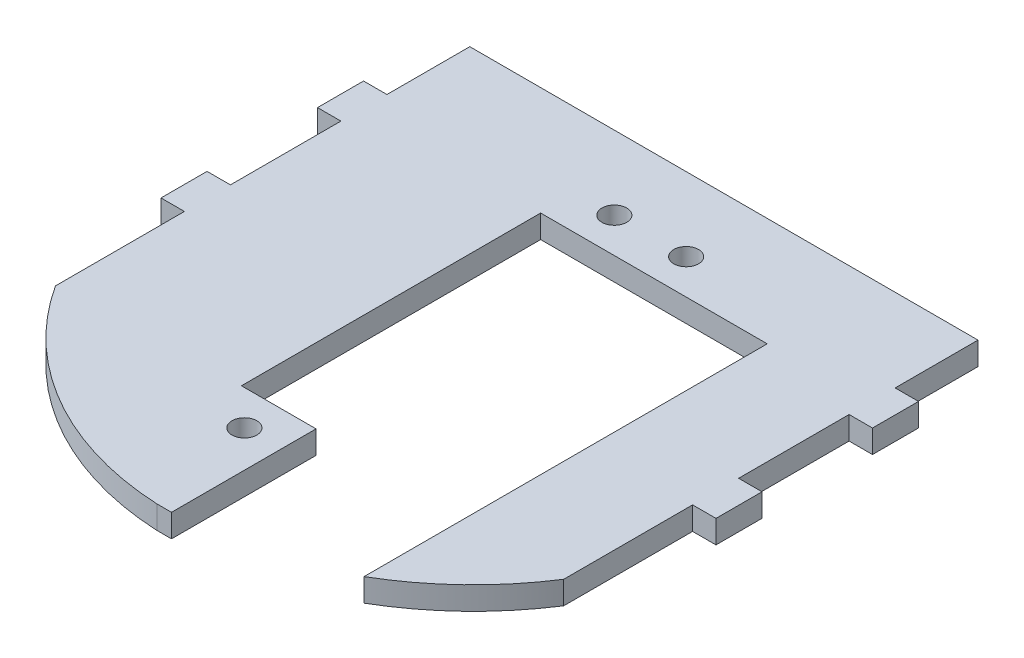
ISO-10303-21;
HEADER;
FILE_DESCRIPTION(('STEP AP214'),'2;1');
FILE_NAME('part.step','',(''),(''),'','','');
FILE_SCHEMA(('AUTOMOTIVE_DESIGN { 1 0 10303 214 1 1 1 1 }'));
ENDSEC;
DATA;
#1=APPLICATION_CONTEXT('core data for automotive mechanical design processes');
#2=APPLICATION_PROTOCOL_DEFINITION('international standard','automotive_design',2000,#1);
#3=PRODUCT_CONTEXT('',#1,'mechanical');
#4=PRODUCT('Part','Part','',(#3));
#5=PRODUCT_RELATED_PRODUCT_CATEGORY('part','',(#4));
#6=PRODUCT_DEFINITION_FORMATION('','',#4);
#7=PRODUCT_DEFINITION_CONTEXT('part definition',#1,'design');
#8=PRODUCT_DEFINITION('design','',#6,#7);
#9=PRODUCT_DEFINITION_SHAPE('','',#8);
#10=(LENGTH_UNIT() NAMED_UNIT(*) SI_UNIT(.MILLI.,.METRE.));
#11=(NAMED_UNIT(*) PLANE_ANGLE_UNIT() SI_UNIT($,.RADIAN.));
#12=(NAMED_UNIT(*) SI_UNIT($,.STERADIAN.) SOLID_ANGLE_UNIT());
#13=UNCERTAINTY_MEASURE_WITH_UNIT(LENGTH_MEASURE(1.E-05),#10,'distance_accuracy_value','');
#14=(GEOMETRIC_REPRESENTATION_CONTEXT(3) GLOBAL_UNCERTAINTY_ASSIGNED_CONTEXT((#13)) GLOBAL_UNIT_ASSIGNED_CONTEXT((#10,
#11,#12)) REPRESENTATION_CONTEXT('',''));
#15=CARTESIAN_POINT('',(0.,0.,0.));
#16=DIRECTION('',(0.,0.,1.));
#17=DIRECTION('',(1.,0.,0.));
#18=AXIS2_PLACEMENT_3D('',#15,#16,#17);
#19=CARTESIAN_POINT('',(35.052,3.175,25.4));
#20=DIRECTION('',(-1.,0.,0.));
#21=DIRECTION('',(0.,0.,1.));
#22=AXIS2_PLACEMENT_3D('',#19,#20,#21);
#23=PLANE('',#22);
#24=DIRECTION('',(0.,1.,0.));
#25=VECTOR('',#24,1.);
#26=CARTESIAN_POINT('',(35.052,0.,7.62));
#27=LINE('',#26,#25);
#28=CARTESIAN_POINT('',(35.052,0.,7.62));
#29=VERTEX_POINT('',#28);
#30=CARTESIAN_POINT('',(35.052,3.175,7.62));
#31=VERTEX_POINT('',#30);
#32=EDGE_CURVE('E367',#29,#31,#27,.T.);
#33=ORIENTED_EDGE('',*,*,#32,.F.);
#34=DIRECTION('',(0.,0.,-1.));
#35=VECTOR('',#34,1.);
#36=CARTESIAN_POINT('',(35.052,0.,25.4));
#37=LINE('',#36,#35);
#38=CARTESIAN_POINT('',(35.052,0.,-7.62));
#39=VERTEX_POINT('',#38);
#40=EDGE_CURVE('E290',#29,#39,#37,.T.);
#41=ORIENTED_EDGE('',*,*,#40,.T.);
#42=DIRECTION('',(0.,1.,0.));
#43=VECTOR('',#42,1.);
#44=CARTESIAN_POINT('',(35.052,0.,-7.62));
#45=LINE('',#44,#43);
#46=CARTESIAN_POINT('',(35.052,3.175,-7.62));
#47=VERTEX_POINT('',#46);
#48=EDGE_CURVE('E324',#39,#47,#45,.T.);
#49=ORIENTED_EDGE('',*,*,#48,.T.);
#50=DIRECTION('',(0.,0.,-1.));
#51=VECTOR('',#50,1.);
#52=CARTESIAN_POINT('',(35.052,3.175,25.4));
#53=LINE('',#52,#51);
#54=EDGE_CURVE('E306',#31,#47,#53,.T.);
#55=ORIENTED_EDGE('',*,*,#54,.F.);
#56=EDGE_LOOP('',(#33,#41,#49,#55));
#57=FACE_BOUND('',#56,.T.);
#58=ADVANCED_FACE('F33',(#57),#23,.F.);
#59=CARTESIAN_POINT('',(35.052,3.175,31.75));
#60=VERTEX_POINT('',#59);
#61=CARTESIAN_POINT('',(35.052,3.175,13.97));
#62=VERTEX_POINT('',#61);
#63=EDGE_CURVE('E36',#60,#62,#53,.T.);
#64=ORIENTED_EDGE('',*,*,#63,.F.);
#65=DIRECTION('',(0.,1.,0.));
#66=VECTOR('',#65,1.);
#67=CARTESIAN_POINT('',(35.052,-5.00000000001367E-05,31.75));
#68=LINE('',#67,#66);
#69=CARTESIAN_POINT('',(35.052,0.,31.75));
#70=VERTEX_POINT('',#69);
#71=EDGE_CURVE('E227',#70,#60,#68,.T.);
#72=ORIENTED_EDGE('',*,*,#71,.F.);
#73=CARTESIAN_POINT('',(35.052,0.,13.97));
#74=VERTEX_POINT('',#73);
#75=EDGE_CURVE('E289',#70,#74,#37,.T.);
#76=ORIENTED_EDGE('',*,*,#75,.T.);
#77=DIRECTION('',(0.,1.,0.));
#78=VECTOR('',#77,1.);
#79=CARTESIAN_POINT('',(35.052,0.,13.97));
#80=LINE('',#79,#78);
#81=EDGE_CURVE('E374',#74,#62,#80,.T.);
#82=ORIENTED_EDGE('',*,*,#81,.T.);
#83=EDGE_LOOP('',(#64,#72,#76,#82));
#84=FACE_BOUND('',#83,.T.);
#85=ADVANCED_FACE('F400',(#84),#23,.F.);
#86=DIRECTION('',(0.,1.,0.));
#87=VECTOR('',#86,1.);
#88=CARTESIAN_POINT('',(35.052,0.,-13.97));
#89=LINE('',#88,#87);
#90=CARTESIAN_POINT('',(35.052,0.,-13.97));
#91=VERTEX_POINT('',#90);
#92=CARTESIAN_POINT('',(35.052,3.175,-13.97));
#93=VERTEX_POINT('',#92);
#94=EDGE_CURVE('E328',#91,#93,#89,.T.);
#95=ORIENTED_EDGE('',*,*,#94,.F.);
#96=CARTESIAN_POINT('',(35.052,0.,-25.4));
#97=VERTEX_POINT('',#96);
#98=EDGE_CURVE('E246',#91,#97,#37,.T.);
#99=ORIENTED_EDGE('',*,*,#98,.T.);
#100=DIRECTION('',(0.,-1.,0.));
#101=VECTOR('',#100,1.);
#102=CARTESIAN_POINT('',(35.052,3.175,-25.4));
#103=LINE('',#102,#101);
#104=CARTESIAN_POINT('',(35.052,3.175,-25.4));
#105=VERTEX_POINT('',#104);
#106=EDGE_CURVE('E269',#105,#97,#103,.T.);
#107=ORIENTED_EDGE('',*,*,#106,.F.);
#108=EDGE_CURVE('E308',#93,#105,#53,.T.);
#109=ORIENTED_EDGE('',*,*,#108,.F.);
#110=EDGE_LOOP('',(#95,#99,#107,#109));
#111=FACE_BOUND('',#110,.T.);
#112=ADVANCED_FACE('F401',(#111),#23,.F.);
#113=CARTESIAN_POINT('',(-35.052,3.175,25.4));
#114=DIRECTION('',(1.,0.,0.));
#115=DIRECTION('',(0.,0.,-1.));
#116=AXIS2_PLACEMENT_3D('',#113,#114,#115);
#117=PLANE('',#116);
#118=DIRECTION('',(0.,0.,1.));
#119=VECTOR('',#118,1.);
#120=CARTESIAN_POINT('',(-35.052,0.,25.4));
#121=LINE('',#120,#119);
#122=CARTESIAN_POINT('',(-35.052,0.,-7.62));
#123=VERTEX_POINT('',#122);
#124=CARTESIAN_POINT('',(-35.052,0.,7.62));
#125=VERTEX_POINT('',#124);
#126=EDGE_CURVE('E259',#123,#125,#121,.T.);
#127=ORIENTED_EDGE('',*,*,#126,.T.);
#128=DIRECTION('',(0.,1.,0.));
#129=VECTOR('',#128,1.);
#130=CARTESIAN_POINT('',(-35.052,0.,7.62));
#131=LINE('',#130,#129);
#132=CARTESIAN_POINT('',(-35.052,3.175,7.62));
#133=VERTEX_POINT('',#132);
#134=EDGE_CURVE('E458',#125,#133,#131,.T.);
#135=ORIENTED_EDGE('',*,*,#134,.T.);
#136=DIRECTION('',(0.,0.,1.));
#137=VECTOR('',#136,1.);
#138=CARTESIAN_POINT('',(-35.052,3.175,25.4));
#139=LINE('',#138,#137);
#140=CARTESIAN_POINT('',(-35.052,3.175,-7.62));
#141=VERTEX_POINT('',#140);
#142=EDGE_CURVE('E234',#141,#133,#139,.T.);
#143=ORIENTED_EDGE('',*,*,#142,.F.);
#144=DIRECTION('',(0.,1.,0.));
#145=VECTOR('',#144,1.);
#146=CARTESIAN_POINT('',(-35.052,0.,-7.62));
#147=LINE('',#146,#145);
#148=EDGE_CURVE('E450',#123,#141,#147,.T.);
#149=ORIENTED_EDGE('',*,*,#148,.F.);
#150=EDGE_LOOP('',(#127,#135,#143,#149));
#151=FACE_BOUND('',#150,.T.);
#152=ADVANCED_FACE('F406',(#151),#117,.F.);
#153=CARTESIAN_POINT('',(-35.052,0.,13.97));
#154=VERTEX_POINT('',#153);
#155=CARTESIAN_POINT('',(-35.052,0.,31.75));
#156=VERTEX_POINT('',#155);
#157=EDGE_CURVE('E226',#154,#156,#121,.T.);
#158=ORIENTED_EDGE('',*,*,#157,.T.);
#159=DIRECTION('',(0.,1.,0.));
#160=VECTOR('',#159,1.);
#161=CARTESIAN_POINT('',(-35.052,-5.00000000001367E-05,31.75));
#162=LINE('',#161,#160);
#163=CARTESIAN_POINT('',(-35.052,3.175,31.75));
#164=VERTEX_POINT('',#163);
#165=EDGE_CURVE('E214',#156,#164,#162,.T.);
#166=ORIENTED_EDGE('',*,*,#165,.T.);
#167=CARTESIAN_POINT('',(-35.052,3.175,13.97));
#168=VERTEX_POINT('',#167);
#169=EDGE_CURVE('E224',#168,#164,#139,.T.);
#170=ORIENTED_EDGE('',*,*,#169,.F.);
#171=DIRECTION('',(0.,1.,0.));
#172=VECTOR('',#171,1.);
#173=CARTESIAN_POINT('',(-35.052,0.,13.97));
#174=LINE('',#173,#172);
#175=EDGE_CURVE('E461',#154,#168,#174,.T.);
#176=ORIENTED_EDGE('',*,*,#175,.F.);
#177=EDGE_LOOP('',(#158,#166,#170,#176));
#178=FACE_BOUND('',#177,.T.);
#179=ADVANCED_FACE('F222',(#178),#117,.F.);
#180=CARTESIAN_POINT('',(-35.052,3.175,-25.4));
#181=DIRECTION('',(0.,0.,1.));
#182=DIRECTION('',(1.,0.,0.));
#183=AXIS2_PLACEMENT_3D('',#180,#181,#182);
#184=PLANE('',#183);
#185=DIRECTION('',(-1.,0.,0.));
#186=VECTOR('',#185,1.);
#187=CARTESIAN_POINT('',(-35.052,0.,-25.4));
#188=LINE('',#187,#186);
#189=CARTESIAN_POINT('',(-35.052,0.,-25.4));
#190=VERTEX_POINT('',#189);
#191=EDGE_CURVE('E265',#97,#190,#188,.T.);
#192=ORIENTED_EDGE('',*,*,#191,.T.);
#193=DIRECTION('',(0.,-1.,0.));
#194=VECTOR('',#193,1.);
#195=CARTESIAN_POINT('',(-35.052,3.175,-25.4));
#196=LINE('',#195,#194);
#197=CARTESIAN_POINT('',(-35.052,3.175,-25.4));
#198=VERTEX_POINT('',#197);
#199=EDGE_CURVE('E258',#198,#190,#196,.T.);
#200=ORIENTED_EDGE('',*,*,#199,.F.);
#201=DIRECTION('',(-1.,0.,0.));
#202=VECTOR('',#201,1.);
#203=CARTESIAN_POINT('',(-35.052,3.175,-25.4));
#204=LINE('',#203,#202);
#205=EDGE_CURVE('E235',#105,#198,#204,.T.);
#206=ORIENTED_EDGE('',*,*,#205,.F.);
#207=ORIENTED_EDGE('',*,*,#106,.T.);
#208=EDGE_LOOP('',(#192,#200,#206,#207));
#209=FACE_BOUND('',#208,.T.);
#210=ADVANCED_FACE('F416',(#209),#184,.F.);
#211=CARTESIAN_POINT('',(-35.052,0.,-13.97));
#212=VERTEX_POINT('',#211);
#213=EDGE_CURVE('E261',#190,#212,#121,.T.);
#214=ORIENTED_EDGE('',*,*,#213,.T.);
#215=DIRECTION('',(0.,1.,0.));
#216=VECTOR('',#215,1.);
#217=CARTESIAN_POINT('',(-35.052,0.,-13.97));
#218=LINE('',#217,#216);
#219=CARTESIAN_POINT('',(-35.052,3.175,-13.97));
#220=VERTEX_POINT('',#219);
#221=EDGE_CURVE('E422',#212,#220,#218,.T.);
#222=ORIENTED_EDGE('',*,*,#221,.T.);
#223=EDGE_CURVE('E238',#198,#220,#139,.T.);
#224=ORIENTED_EDGE('',*,*,#223,.F.);
#225=ORIENTED_EDGE('',*,*,#199,.T.);
#226=EDGE_LOOP('',(#214,#222,#224,#225));
#227=FACE_BOUND('',#226,.T.);
#228=ADVANCED_FACE('F413',(#227),#117,.F.);
#229=CARTESIAN_POINT('',(35.052,3.175,-25.4));
#230=DIRECTION('',(0.,-1.,0.));
#231=DIRECTION('',(0.,0.,-1.));
#232=AXIS2_PLACEMENT_3D('',#229,#230,#231);
#233=PLANE('',#232);
#234=CARTESIAN_POINT('',(-5.05620664108055,3.175,35.687));
#235=DIRECTION('',(0.,1.,0.));
#236=DIRECTION('',(0.,0.,1.));
#237=AXIS2_PLACEMENT_3D('',#234,#235,#236);
#238=CIRCLE('',#237,1.7145);
#239=CARTESIAN_POINT('',(-5.05620664108055,3.175,37.4015));
#240=VERTEX_POINT('',#239);
#241=EDGE_CURVE('E802',#240,#240,#238,.T.);
#242=ORIENTED_EDGE('',*,*,#241,.F.);
#243=EDGE_LOOP('',(#242));
#244=FACE_BOUND('',#243,.T.);
#245=CARTESIAN_POINT('',(-4.95500000000003,3.175,-15.24));
#246=DIRECTION('',(0.,1.,0.));
#247=DIRECTION('',(0.,0.,1.));
#248=AXIS2_PLACEMENT_3D('',#245,#246,#247);
#249=CIRCLE('',#248,1.7145);
#250=CARTESIAN_POINT('',(-4.95500000000003,3.175,-13.5255));
#251=VERTEX_POINT('',#250);
#252=EDGE_CURVE('E799',#251,#251,#249,.T.);
#253=ORIENTED_EDGE('',*,*,#252,.F.);
#254=EDGE_LOOP('',(#253));
#255=FACE_BOUND('',#254,.T.);
#256=CARTESIAN_POINT('',(4.95499999999996,3.175,-15.24));
#257=DIRECTION('',(0.,1.,0.));
#258=DIRECTION('',(0.,0.,1.));
#259=AXIS2_PLACEMENT_3D('',#256,#257,#258);
#260=CIRCLE('',#259,1.7145);
#261=CARTESIAN_POINT('',(4.95499999999996,3.175,-13.5255));
#262=VERTEX_POINT('',#261);
#263=EDGE_CURVE('E795',#262,#262,#260,.T.);
#264=ORIENTED_EDGE('',*,*,#263,.F.);
#265=EDGE_LOOP('',(#264));
#266=FACE_BOUND('',#265,.T.);
#267=ORIENTED_EDGE('',*,*,#169,.T.);
#268=CARTESIAN_POINT('',(0.,3.175,9.13421887485182));
#269=DIRECTION('',(0.,-1.,0.));
#270=DIRECTION('',(0.,0.,1.));
#271=AXIS2_PLACEMENT_3D('',#268,#269,#270);
#272=CIRCLE('',#271,41.7147007648456);
#273=CARTESIAN_POINT('',(-2.01963935687884,3.175,50.8));
#274=VERTEX_POINT('',#273);
#275=EDGE_CURVE('E211',#274,#164,#272,.T.);
#276=ORIENTED_EDGE('',*,*,#275,.F.);
#277=DIRECTION('',(1.,0.,0.));
#278=VECTOR('',#277,1.);
#279=CARTESIAN_POINT('',(35.052,3.175,50.8));
#280=LINE('',#279,#278);
#281=CARTESIAN_POINT('',(0.,3.175,50.8));
#282=VERTEX_POINT('',#281);
#283=EDGE_CURVE('E792',#274,#282,#280,.T.);
#284=ORIENTED_EDGE('',*,*,#283,.T.);
#285=DIRECTION('',(0.,0.,1.));
#286=VECTOR('',#285,1.);
#287=CARTESIAN_POINT('',(0.,3.175,30.861));
#288=LINE('',#287,#286);
#289=CARTESIAN_POINT('',(0.,3.175,30.861));
#290=VERTEX_POINT('',#289);
#291=EDGE_CURVE('E829',#290,#282,#288,.T.);
#292=ORIENTED_EDGE('',*,*,#291,.F.);
#293=DIRECTION('',(1.,0.,0.));
#294=VECTOR('',#293,1.);
#295=CARTESIAN_POINT('',(-10.2930000000001,3.175,30.861));
#296=LINE('',#295,#294);
#297=CARTESIAN_POINT('',(-10.2930000000001,3.175,30.861));
#298=VERTEX_POINT('',#297);
#299=EDGE_CURVE('E812',#298,#290,#296,.T.);
#300=ORIENTED_EDGE('',*,*,#299,.F.);
#301=DIRECTION('',(0.,0.,1.));
#302=VECTOR('',#301,1.);
#303=CARTESIAN_POINT('',(-10.2930000000001,3.175,-10.414));
#304=LINE('',#303,#302);
#305=CARTESIAN_POINT('',(-10.2930000000001,3.175,-10.414));
#306=VERTEX_POINT('',#305);
#307=EDGE_CURVE('E815',#306,#298,#304,.T.);
#308=ORIENTED_EDGE('',*,*,#307,.F.);
#309=DIRECTION('',(-1.,0.,0.));
#310=VECTOR('',#309,1.);
#311=CARTESIAN_POINT('',(10.293,3.175,-10.414));
#312=LINE('',#311,#310);
#313=CARTESIAN_POINT('',(20.961,3.175,-10.414));
#314=VERTEX_POINT('',#313);
#315=EDGE_CURVE('E808',#314,#306,#312,.T.);
#316=ORIENTED_EDGE('',*,*,#315,.F.);
#317=DIRECTION('',(0.,0.,-1.));
#318=VECTOR('',#317,1.);
#319=CARTESIAN_POINT('',(20.961,3.175,50.8));
#320=LINE('',#319,#318);
#321=CARTESIAN_POINT('',(20.961,3.175,45.2001687292589));
#322=VERTEX_POINT('',#321);
#323=EDGE_CURVE('E825',#322,#314,#320,.T.);
#324=ORIENTED_EDGE('',*,*,#323,.F.);
#325=EDGE_CURVE('E58',#60,#322,#272,.T.);
#326=ORIENTED_EDGE('',*,*,#325,.F.);
#327=ORIENTED_EDGE('',*,*,#63,.T.);
#328=DIRECTION('',(-1.,0.,0.));
#329=VECTOR('',#328,1.);
#330=CARTESIAN_POINT('',(35.052,3.175,13.97));
#331=LINE('',#330,#329);
#332=CARTESIAN_POINT('',(38.2778,3.175,13.97));
#333=VERTEX_POINT('',#332);
#334=EDGE_CURVE('E782',#333,#62,#331,.T.);
#335=ORIENTED_EDGE('',*,*,#334,.F.);
#336=DIRECTION('',(0.,0.,1.));
#337=VECTOR('',#336,1.);
#338=CARTESIAN_POINT('',(38.2778,3.175,7.62));
#339=LINE('',#338,#337);
#340=CARTESIAN_POINT('',(38.2778,3.175,7.62));
#341=VERTEX_POINT('',#340);
#342=EDGE_CURVE('E783',#341,#333,#339,.T.);
#343=ORIENTED_EDGE('',*,*,#342,.F.);
#344=DIRECTION('',(1.,0.,0.));
#345=VECTOR('',#344,1.);
#346=CARTESIAN_POINT('',(35.052,3.175,7.62));
#347=LINE('',#346,#345);
#348=EDGE_CURVE('E365',#31,#341,#347,.T.);
#349=ORIENTED_EDGE('',*,*,#348,.F.);
#350=ORIENTED_EDGE('',*,*,#54,.T.);
#351=DIRECTION('',(-1.,0.,0.));
#352=VECTOR('',#351,1.);
#353=CARTESIAN_POINT('',(35.052,3.175,-7.62));
#354=LINE('',#353,#352);
#355=CARTESIAN_POINT('',(38.2778,3.175,-7.62));
#356=VERTEX_POINT('',#355);
#357=EDGE_CURVE('E317',#356,#47,#354,.T.);
#358=ORIENTED_EDGE('',*,*,#357,.F.);
#359=DIRECTION('',(0.,0.,1.));
#360=VECTOR('',#359,1.);
#361=CARTESIAN_POINT('',(38.2778,3.175,-7.62));
#362=LINE('',#361,#360);
#363=CARTESIAN_POINT('',(38.2778,3.175,-13.97));
#364=VERTEX_POINT('',#363);
#365=EDGE_CURVE('E320',#364,#356,#362,.T.);
#366=ORIENTED_EDGE('',*,*,#365,.F.);
#367=DIRECTION('',(1.,0.,0.));
#368=VECTOR('',#367,1.);
#369=CARTESIAN_POINT('',(35.052,3.175,-13.97));
#370=LINE('',#369,#368);
#371=EDGE_CURVE('E347',#93,#364,#370,.T.);
#372=ORIENTED_EDGE('',*,*,#371,.F.);
#373=ORIENTED_EDGE('',*,*,#108,.T.);
#374=ORIENTED_EDGE('',*,*,#205,.T.);
#375=ORIENTED_EDGE('',*,*,#223,.T.);
#376=DIRECTION('',(-1.,0.,0.));
#377=VECTOR('',#376,1.);
#378=CARTESIAN_POINT('',(-35.052,3.175,-13.97));
#379=LINE('',#378,#377);
#380=CARTESIAN_POINT('',(-38.2778,3.175,-13.97));
#381=VERTEX_POINT('',#380);
#382=EDGE_CURVE('E425',#220,#381,#379,.T.);
#383=ORIENTED_EDGE('',*,*,#382,.T.);
#384=DIRECTION('',(0.,0.,1.));
#385=VECTOR('',#384,1.);
#386=CARTESIAN_POINT('',(-38.2778,3.175,-7.62));
#387=LINE('',#386,#385);
#388=CARTESIAN_POINT('',(-38.2778,3.175,-7.62));
#389=VERTEX_POINT('',#388);
#390=EDGE_CURVE('E428',#381,#389,#387,.T.);
#391=ORIENTED_EDGE('',*,*,#390,.T.);
#392=DIRECTION('',(1.,0.,0.));
#393=VECTOR('',#392,1.);
#394=CARTESIAN_POINT('',(-35.052,3.175,-7.62));
#395=LINE('',#394,#393);
#396=EDGE_CURVE('E430',#389,#141,#395,.T.);
#397=ORIENTED_EDGE('',*,*,#396,.T.);
#398=ORIENTED_EDGE('',*,*,#142,.T.);
#399=DIRECTION('',(-1.,0.,0.));
#400=VECTOR('',#399,1.);
#401=CARTESIAN_POINT('',(-35.052,3.175,7.62));
#402=LINE('',#401,#400);
#403=CARTESIAN_POINT('',(-38.2778,3.175,7.62));
#404=VERTEX_POINT('',#403);
#405=EDGE_CURVE('E327',#133,#404,#402,.T.);
#406=ORIENTED_EDGE('',*,*,#405,.T.);
#407=DIRECTION('',(0.,0.,1.));
#408=VECTOR('',#407,1.);
#409=CARTESIAN_POINT('',(-38.2778,3.175,7.62));
#410=LINE('',#409,#408);
#411=CARTESIAN_POINT('',(-38.2778,3.175,13.97));
#412=VERTEX_POINT('',#411);
#413=EDGE_CURVE('E486',#404,#412,#410,.T.);
#414=ORIENTED_EDGE('',*,*,#413,.T.);
#415=DIRECTION('',(1.,0.,0.));
#416=VECTOR('',#415,1.);
#417=CARTESIAN_POINT('',(-35.052,3.175,13.97));
#418=LINE('',#417,#416);
#419=EDGE_CURVE('E233',#412,#168,#418,.T.);
#420=ORIENTED_EDGE('',*,*,#419,.T.);
#421=EDGE_LOOP('',(#267,#276,#284,#292,#300,#308,#316,#324,#326,#327,#335,#343,#349,#350,#358,
#366,#372,#373,#374,#375,#383,#391,#397,#398,#406,#414,#420));
#422=FACE_BOUND('',#421,.T.);
#423=ADVANCED_FACE('F230',(#244,#255,#266,#422),#233,.F.);
#424=CARTESIAN_POINT('',(35.052,0.,-25.4));
#425=DIRECTION('',(0.,-1.,0.));
#426=DIRECTION('',(0.,0.,-1.));
#427=AXIS2_PLACEMENT_3D('',#424,#425,#426);
#428=PLANE('',#427);
#429=CARTESIAN_POINT('',(0.,0.,9.13421887485182));
#430=DIRECTION('',(0.,-1.,0.));
#431=DIRECTION('',(0.,0.,-1.));
#432=AXIS2_PLACEMENT_3D('',#429,#430,#431);
#433=CIRCLE('',#432,41.7147007648456);
#434=CARTESIAN_POINT('',(-2.01963935687868,0.,50.8));
#435=VERTEX_POINT('',#434);
#436=EDGE_CURVE('E50',#156,#435,#433,.F.);
#437=ORIENTED_EDGE('',*,*,#436,.F.);
#438=ORIENTED_EDGE('',*,*,#157,.F.);
#439=DIRECTION('',(1.,0.,0.));
#440=VECTOR('',#439,1.);
#441=CARTESIAN_POINT('',(-35.052,0.,13.97));
#442=LINE('',#441,#440);
#443=CARTESIAN_POINT('',(-38.2778,0.,13.97));
#444=VERTEX_POINT('',#443);
#445=EDGE_CURVE('E470',#444,#154,#442,.T.);
#446=ORIENTED_EDGE('',*,*,#445,.F.);
#447=DIRECTION('',(0.,0.,1.));
#448=VECTOR('',#447,1.);
#449=CARTESIAN_POINT('',(-38.2778,0.,7.62));
#450=LINE('',#449,#448);
#451=CARTESIAN_POINT('',(-38.2778,0.,7.62));
#452=VERTEX_POINT('',#451);
#453=EDGE_CURVE('E476',#452,#444,#450,.T.);
#454=ORIENTED_EDGE('',*,*,#453,.F.);
#455=DIRECTION('',(-1.,0.,0.));
#456=VECTOR('',#455,1.);
#457=CARTESIAN_POINT('',(-35.052,0.,7.62));
#458=LINE('',#457,#456);
#459=EDGE_CURVE('E481',#125,#452,#458,.T.);
#460=ORIENTED_EDGE('',*,*,#459,.F.);
#461=ORIENTED_EDGE('',*,*,#126,.F.);
#462=DIRECTION('',(1.,0.,0.));
#463=VECTOR('',#462,1.);
#464=CARTESIAN_POINT('',(-35.052,0.,-7.62));
#465=LINE('',#464,#463);
#466=CARTESIAN_POINT('',(-38.2778,0.,-7.62));
#467=VERTEX_POINT('',#466);
#468=EDGE_CURVE('E437',#467,#123,#465,.T.);
#469=ORIENTED_EDGE('',*,*,#468,.F.);
#470=DIRECTION('',(0.,0.,1.));
#471=VECTOR('',#470,1.);
#472=CARTESIAN_POINT('',(-38.2778,0.,-7.62));
#473=LINE('',#472,#471);
#474=CARTESIAN_POINT('',(-38.2778,0.,-13.97));
#475=VERTEX_POINT('',#474);
#476=EDGE_CURVE('E443',#475,#467,#473,.T.);
#477=ORIENTED_EDGE('',*,*,#476,.F.);
#478=DIRECTION('',(-1.,0.,0.));
#479=VECTOR('',#478,1.);
#480=CARTESIAN_POINT('',(-35.052,0.,-13.97));
#481=LINE('',#480,#479);
#482=EDGE_CURVE('E439',#212,#475,#481,.T.);
#483=ORIENTED_EDGE('',*,*,#482,.F.);
#484=ORIENTED_EDGE('',*,*,#213,.F.);
#485=ORIENTED_EDGE('',*,*,#191,.F.);
#486=ORIENTED_EDGE('',*,*,#98,.F.);
#487=DIRECTION('',(1.,0.,0.));
#488=VECTOR('',#487,1.);
#489=CARTESIAN_POINT('',(35.052,0.,-13.97));
#490=LINE('',#489,#488);
#491=CARTESIAN_POINT('',(38.2778,0.,-13.97));
#492=VERTEX_POINT('',#491);
#493=EDGE_CURVE('E342',#91,#492,#490,.T.);
#494=ORIENTED_EDGE('',*,*,#493,.T.);
#495=DIRECTION('',(0.,0.,1.));
#496=VECTOR('',#495,1.);
#497=CARTESIAN_POINT('',(38.2778,0.,-7.62));
#498=LINE('',#497,#496);
#499=CARTESIAN_POINT('',(38.2778,0.,-7.62));
#500=VERTEX_POINT('',#499);
#501=EDGE_CURVE('E345',#492,#500,#498,.T.);
#502=ORIENTED_EDGE('',*,*,#501,.T.);
#503=DIRECTION('',(-1.,0.,0.));
#504=VECTOR('',#503,1.);
#505=CARTESIAN_POINT('',(35.052,0.,-7.62));
#506=LINE('',#505,#504);
#507=EDGE_CURVE('E329',#500,#39,#506,.T.);
#508=ORIENTED_EDGE('',*,*,#507,.T.);
#509=ORIENTED_EDGE('',*,*,#40,.F.);
#510=DIRECTION('',(1.,0.,0.));
#511=VECTOR('',#510,1.);
#512=CARTESIAN_POINT('',(35.052,0.,7.62));
#513=LINE('',#512,#511);
#514=CARTESIAN_POINT('',(38.2778,0.,7.62));
#515=VERTEX_POINT('',#514);
#516=EDGE_CURVE('E373',#29,#515,#513,.T.);
#517=ORIENTED_EDGE('',*,*,#516,.T.);
#518=DIRECTION('',(0.,0.,1.));
#519=VECTOR('',#518,1.);
#520=CARTESIAN_POINT('',(38.2778,0.,7.62));
#521=LINE('',#520,#519);
#522=CARTESIAN_POINT('',(38.2778,0.,13.97));
#523=VERTEX_POINT('',#522);
#524=EDGE_CURVE('E375',#515,#523,#521,.T.);
#525=ORIENTED_EDGE('',*,*,#524,.T.);
#526=DIRECTION('',(-1.,0.,0.));
#527=VECTOR('',#526,1.);
#528=CARTESIAN_POINT('',(35.052,0.,13.97));
#529=LINE('',#528,#527);
#530=EDGE_CURVE('E379',#523,#74,#529,.T.);
#531=ORIENTED_EDGE('',*,*,#530,.T.);
#532=ORIENTED_EDGE('',*,*,#75,.F.);
#533=CARTESIAN_POINT('',(20.961,0.,45.2001687292589));
#534=VERTEX_POINT('',#533);
#535=EDGE_CURVE('E769',#534,#70,#433,.F.);
#536=ORIENTED_EDGE('',*,*,#535,.F.);
#537=DIRECTION('',(0.,0.,1.));
#538=VECTOR('',#537,1.);
#539=CARTESIAN_POINT('',(20.961,0.,-25.4));
#540=LINE('',#539,#538);
#541=CARTESIAN_POINT('',(20.961,0.,-10.414));
#542=VERTEX_POINT('',#541);
#543=EDGE_CURVE('E817',#542,#534,#540,.T.);
#544=ORIENTED_EDGE('',*,*,#543,.F.);
#545=DIRECTION('',(1.,0.,0.));
#546=VECTOR('',#545,1.);
#547=CARTESIAN_POINT('',(35.052,0.,-10.414));
#548=LINE('',#547,#546);
#549=CARTESIAN_POINT('',(-10.2930000000001,0.,-10.414));
#550=VERTEX_POINT('',#549);
#551=EDGE_CURVE('E275',#550,#542,#548,.T.);
#552=ORIENTED_EDGE('',*,*,#551,.F.);
#553=DIRECTION('',(0.,0.,-1.));
#554=VECTOR('',#553,1.);
#555=CARTESIAN_POINT('',(-10.2930000000001,0.,-25.4));
#556=LINE('',#555,#554);
#557=CARTESIAN_POINT('',(-10.2930000000001,0.,30.861));
#558=VERTEX_POINT('',#557);
#559=EDGE_CURVE('E282',#558,#550,#556,.T.);
#560=ORIENTED_EDGE('',*,*,#559,.F.);
#561=DIRECTION('',(-1.,0.,0.));
#562=VECTOR('',#561,1.);
#563=CARTESIAN_POINT('',(35.052,0.,30.861));
#564=LINE('',#563,#562);
#565=CARTESIAN_POINT('',(0.,0.,30.861));
#566=VERTEX_POINT('',#565);
#567=EDGE_CURVE('E271',#566,#558,#564,.T.);
#568=ORIENTED_EDGE('',*,*,#567,.F.);
#569=DIRECTION('',(0.,0.,-1.));
#570=VECTOR('',#569,1.);
#571=CARTESIAN_POINT('',(-1.11022302462516E-13,0.,-25.3999999999999));
#572=LINE('',#571,#570);
#573=CARTESIAN_POINT('',(0.,0.,50.8));
#574=VERTEX_POINT('',#573);
#575=EDGE_CURVE('E819',#574,#566,#572,.T.);
#576=ORIENTED_EDGE('',*,*,#575,.F.);
#577=DIRECTION('',(1.,0.,0.));
#578=VECTOR('',#577,1.);
#579=CARTESIAN_POINT('',(35.052,0.,50.8));
#580=LINE('',#579,#578);
#581=EDGE_CURVE('E786',#435,#574,#580,.T.);
#582=ORIENTED_EDGE('',*,*,#581,.F.);
#583=EDGE_LOOP('',(#437,#438,#446,#454,#460,#461,#469,#477,#483,#484,#485,#486,#494,#502,#508,
#509,#517,#525,#531,#532,#536,#544,#552,#560,#568,#576,#582));
#584=FACE_BOUND('',#583,.T.);
#585=CARTESIAN_POINT('',(-5.05620664108055,0.,35.687));
#586=DIRECTION('',(0.,-1.,0.));
#587=DIRECTION('',(0.,0.,-1.));
#588=AXIS2_PLACEMENT_3D('',#585,#586,#587);
#589=CIRCLE('',#588,1.7145);
#590=CARTESIAN_POINT('',(-5.05620664108055,0.,33.9725));
#591=VERTEX_POINT('',#590);
#592=EDGE_CURVE('E285',#591,#591,#589,.T.);
#593=ORIENTED_EDGE('',*,*,#592,.F.);
#594=EDGE_LOOP('',(#593));
#595=FACE_BOUND('',#594,.T.);
#596=CARTESIAN_POINT('',(-4.95500000000003,0.,-15.24));
#597=DIRECTION('',(0.,-1.,0.));
#598=DIRECTION('',(0.,0.,-1.));
#599=AXIS2_PLACEMENT_3D('',#596,#597,#598);
#600=CIRCLE('',#599,1.7145);
#601=CARTESIAN_POINT('',(-4.95500000000003,0.,-16.9545));
#602=VERTEX_POINT('',#601);
#603=EDGE_CURVE('E798',#602,#602,#600,.T.);
#604=ORIENTED_EDGE('',*,*,#603,.F.);
#605=EDGE_LOOP('',(#604));
#606=FACE_BOUND('',#605,.T.);
#607=CARTESIAN_POINT('',(4.95499999999996,0.,-15.24));
#608=DIRECTION('',(0.,-1.,0.));
#609=DIRECTION('',(0.,0.,-1.));
#610=AXIS2_PLACEMENT_3D('',#607,#608,#609);
#611=CIRCLE('',#610,1.7145);
#612=CARTESIAN_POINT('',(4.95499999999996,0.,-16.9545));
#613=VERTEX_POINT('',#612);
#614=EDGE_CURVE('E309',#613,#613,#611,.T.);
#615=ORIENTED_EDGE('',*,*,#614,.F.);
#616=EDGE_LOOP('',(#615));
#617=FACE_BOUND('',#616,.T.);
#618=ADVANCED_FACE('F383',(#584,#595,#606,#617),#428,.T.);
#619=CARTESIAN_POINT('',(-35.052,0.,-7.62));
#620=DIRECTION('',(0.,0.,1.));
#621=DIRECTION('',(1.,0.,0.));
#622=AXIS2_PLACEMENT_3D('',#619,#620,#621);
#623=PLANE('',#622);
#624=ORIENTED_EDGE('',*,*,#396,.F.);
#625=DIRECTION('',(0.,1.,0.));
#626=VECTOR('',#625,1.);
#627=CARTESIAN_POINT('',(-38.2778,0.,-7.62));
#628=LINE('',#627,#626);
#629=EDGE_CURVE('E301',#467,#389,#628,.T.);
#630=ORIENTED_EDGE('',*,*,#629,.F.);
#631=ORIENTED_EDGE('',*,*,#468,.T.);
#632=ORIENTED_EDGE('',*,*,#148,.T.);
#633=EDGE_LOOP('',(#624,#630,#631,#632));
#634=FACE_BOUND('',#633,.T.);
#635=ADVANCED_FACE('F495',(#634),#623,.T.);
#636=CARTESIAN_POINT('',(-38.2778,0.,-7.62));
#637=DIRECTION('',(-1.,0.,0.));
#638=DIRECTION('',(0.,0.,1.));
#639=AXIS2_PLACEMENT_3D('',#636,#637,#638);
#640=PLANE('',#639);
#641=ORIENTED_EDGE('',*,*,#390,.F.);
#642=DIRECTION('',(0.,1.,0.));
#643=VECTOR('',#642,1.);
#644=CARTESIAN_POINT('',(-38.2778,0.,-13.97));
#645=LINE('',#644,#643);
#646=EDGE_CURVE('E434',#475,#381,#645,.T.);
#647=ORIENTED_EDGE('',*,*,#646,.F.);
#648=ORIENTED_EDGE('',*,*,#476,.T.);
#649=ORIENTED_EDGE('',*,*,#629,.T.);
#650=EDGE_LOOP('',(#641,#647,#648,#649));
#651=FACE_BOUND('',#650,.T.);
#652=ADVANCED_FACE('F432',(#651),#640,.T.);
#653=CARTESIAN_POINT('',(-35.052,0.,-13.97));
#654=DIRECTION('',(0.,0.,-1.));
#655=DIRECTION('',(-1.,0.,0.));
#656=AXIS2_PLACEMENT_3D('',#653,#654,#655);
#657=PLANE('',#656);
#658=ORIENTED_EDGE('',*,*,#382,.F.);
#659=ORIENTED_EDGE('',*,*,#221,.F.);
#660=ORIENTED_EDGE('',*,*,#482,.T.);
#661=ORIENTED_EDGE('',*,*,#646,.T.);
#662=EDGE_LOOP('',(#658,#659,#660,#661));
#663=FACE_BOUND('',#662,.T.);
#664=ADVANCED_FACE('F498',(#663),#657,.T.);
#665=CARTESIAN_POINT('',(-35.052,0.,7.62));
#666=DIRECTION('',(0.,0.,-1.));
#667=DIRECTION('',(-1.,0.,0.));
#668=AXIS2_PLACEMENT_3D('',#665,#666,#667);
#669=PLANE('',#668);
#670=ORIENTED_EDGE('',*,*,#405,.F.);
#671=ORIENTED_EDGE('',*,*,#134,.F.);
#672=ORIENTED_EDGE('',*,*,#459,.T.);
#673=DIRECTION('',(0.,1.,0.));
#674=VECTOR('',#673,1.);
#675=CARTESIAN_POINT('',(-38.2778,0.,7.62));
#676=LINE('',#675,#674);
#677=EDGE_CURVE('E469',#452,#404,#676,.T.);
#678=ORIENTED_EDGE('',*,*,#677,.T.);
#679=EDGE_LOOP('',(#670,#671,#672,#678));
#680=FACE_BOUND('',#679,.T.);
#681=ADVANCED_FACE('F488',(#680),#669,.T.);
#682=CARTESIAN_POINT('',(-35.052,0.,13.97));
#683=DIRECTION('',(0.,0.,1.));
#684=DIRECTION('',(1.,0.,0.));
#685=AXIS2_PLACEMENT_3D('',#682,#683,#684);
#686=PLANE('',#685);
#687=ORIENTED_EDGE('',*,*,#419,.F.);
#688=DIRECTION('',(0.,1.,0.));
#689=VECTOR('',#688,1.);
#690=CARTESIAN_POINT('',(-38.2778,0.,13.97));
#691=LINE('',#690,#689);
#692=EDGE_CURVE('E464',#444,#412,#691,.T.);
#693=ORIENTED_EDGE('',*,*,#692,.F.);
#694=ORIENTED_EDGE('',*,*,#445,.T.);
#695=ORIENTED_EDGE('',*,*,#175,.T.);
#696=EDGE_LOOP('',(#687,#693,#694,#695));
#697=FACE_BOUND('',#696,.T.);
#698=ADVANCED_FACE('F505',(#697),#686,.T.);
#699=CARTESIAN_POINT('',(-38.2778,0.,7.62));
#700=DIRECTION('',(-1.,0.,0.));
#701=DIRECTION('',(0.,0.,1.));
#702=AXIS2_PLACEMENT_3D('',#699,#700,#701);
#703=PLANE('',#702);
#704=ORIENTED_EDGE('',*,*,#413,.F.);
#705=ORIENTED_EDGE('',*,*,#677,.F.);
#706=ORIENTED_EDGE('',*,*,#453,.T.);
#707=ORIENTED_EDGE('',*,*,#692,.T.);
#708=EDGE_LOOP('',(#704,#705,#706,#707));
#709=FACE_BOUND('',#708,.T.);
#710=ADVANCED_FACE('F396',(#709),#703,.T.);
#711=CARTESIAN_POINT('',(35.052,0.,-7.62));
#712=DIRECTION('',(0.,0.,-1.));
#713=DIRECTION('',(-1.,0.,0.));
#714=AXIS2_PLACEMENT_3D('',#711,#712,#713);
#715=PLANE('',#714);
#716=ORIENTED_EDGE('',*,*,#357,.T.);
#717=ORIENTED_EDGE('',*,*,#48,.F.);
#718=ORIENTED_EDGE('',*,*,#507,.F.);
#719=DIRECTION('',(0.,1.,0.));
#720=VECTOR('',#719,1.);
#721=CARTESIAN_POINT('',(38.2778,0.,-7.62));
#722=LINE('',#721,#720);
#723=EDGE_CURVE('E344',#500,#356,#722,.T.);
#724=ORIENTED_EDGE('',*,*,#723,.T.);
#725=EDGE_LOOP('',(#716,#717,#718,#724));
#726=FACE_BOUND('',#725,.T.);
#727=ADVANCED_FACE('F361',(#726),#715,.F.);
#728=CARTESIAN_POINT('',(35.052,0.,-13.97));
#729=DIRECTION('',(0.,0.,1.));
#730=DIRECTION('',(1.,0.,0.));
#731=AXIS2_PLACEMENT_3D('',#728,#729,#730);
#732=PLANE('',#731);
#733=ORIENTED_EDGE('',*,*,#371,.T.);
#734=DIRECTION('',(0.,1.,0.));
#735=VECTOR('',#734,1.);
#736=CARTESIAN_POINT('',(38.2778,0.,-13.97));
#737=LINE('',#736,#735);
#738=EDGE_CURVE('E337',#492,#364,#737,.T.);
#739=ORIENTED_EDGE('',*,*,#738,.F.);
#740=ORIENTED_EDGE('',*,*,#493,.F.);
#741=ORIENTED_EDGE('',*,*,#94,.T.);
#742=EDGE_LOOP('',(#733,#739,#740,#741));
#743=FACE_BOUND('',#742,.T.);
#744=ADVANCED_FACE('F388',(#743),#732,.F.);
#745=CARTESIAN_POINT('',(38.2778,0.,-7.62));
#746=DIRECTION('',(-1.,0.,0.));
#747=DIRECTION('',(0.,0.,1.));
#748=AXIS2_PLACEMENT_3D('',#745,#746,#747);
#749=PLANE('',#748);
#750=ORIENTED_EDGE('',*,*,#365,.T.);
#751=ORIENTED_EDGE('',*,*,#723,.F.);
#752=ORIENTED_EDGE('',*,*,#501,.F.);
#753=ORIENTED_EDGE('',*,*,#738,.T.);
#754=EDGE_LOOP('',(#750,#751,#752,#753));
#755=FACE_BOUND('',#754,.T.);
#756=ADVANCED_FACE('F356',(#755),#749,.F.);
#757=CARTESIAN_POINT('',(35.052,0.,7.62));
#758=DIRECTION('',(0.,0.,1.));
#759=DIRECTION('',(1.,0.,0.));
#760=AXIS2_PLACEMENT_3D('',#757,#758,#759);
#761=PLANE('',#760);
#762=ORIENTED_EDGE('',*,*,#348,.T.);
#763=DIRECTION('',(0.,1.,0.));
#764=VECTOR('',#763,1.);
#765=CARTESIAN_POINT('',(38.2778,0.,7.62));
#766=LINE('',#765,#764);
#767=EDGE_CURVE('E321',#515,#341,#766,.T.);
#768=ORIENTED_EDGE('',*,*,#767,.F.);
#769=ORIENTED_EDGE('',*,*,#516,.F.);
#770=ORIENTED_EDGE('',*,*,#32,.T.);
#771=EDGE_LOOP('',(#762,#768,#769,#770));
#772=FACE_BOUND('',#771,.T.);
#773=ADVANCED_FACE('F370',(#772),#761,.F.);
#774=CARTESIAN_POINT('',(38.2778,0.,7.62));
#775=DIRECTION('',(-1.,0.,0.));
#776=DIRECTION('',(0.,0.,1.));
#777=AXIS2_PLACEMENT_3D('',#774,#775,#776);
#778=PLANE('',#777);
#779=ORIENTED_EDGE('',*,*,#342,.T.);
#780=DIRECTION('',(0.,1.,0.));
#781=VECTOR('',#780,1.);
#782=CARTESIAN_POINT('',(38.2778,0.,13.97));
#783=LINE('',#782,#781);
#784=EDGE_CURVE('E377',#523,#333,#783,.T.);
#785=ORIENTED_EDGE('',*,*,#784,.F.);
#786=ORIENTED_EDGE('',*,*,#524,.F.);
#787=ORIENTED_EDGE('',*,*,#767,.T.);
#788=EDGE_LOOP('',(#779,#785,#786,#787));
#789=FACE_BOUND('',#788,.T.);
#790=ADVANCED_FACE('F614',(#789),#778,.F.);
#791=CARTESIAN_POINT('',(35.052,0.,13.97));
#792=DIRECTION('',(0.,0.,-1.));
#793=DIRECTION('',(-1.,0.,0.));
#794=AXIS2_PLACEMENT_3D('',#791,#792,#793);
#795=PLANE('',#794);
#796=ORIENTED_EDGE('',*,*,#334,.T.);
#797=ORIENTED_EDGE('',*,*,#81,.F.);
#798=ORIENTED_EDGE('',*,*,#530,.F.);
#799=ORIENTED_EDGE('',*,*,#784,.T.);
#800=EDGE_LOOP('',(#796,#797,#798,#799));
#801=FACE_BOUND('',#800,.T.);
#802=ADVANCED_FACE('F622',(#801),#795,.F.);
#803=CARTESIAN_POINT('',(35.052,0.,50.8));
#804=DIRECTION('',(0.,0.,1.));
#805=DIRECTION('',(1.,0.,0.));
#806=AXIS2_PLACEMENT_3D('',#803,#804,#805);
#807=PLANE('',#806);
#808=DIRECTION('',(0.,1.,0.));
#809=VECTOR('',#808,1.);
#810=CARTESIAN_POINT('',(-2.01963935687868,-5.00000000001367E-05,50.8));
#811=LINE('',#810,#809);
#812=EDGE_CURVE('E215',#435,#274,#811,.T.);
#813=ORIENTED_EDGE('',*,*,#812,.F.);
#814=ORIENTED_EDGE('',*,*,#581,.T.);
#815=DIRECTION('',(0.,1.,0.));
#816=VECTOR('',#815,1.);
#817=CARTESIAN_POINT('',(0.,-5.00000000001367E-05,50.8));
#818=LINE('',#817,#816);
#819=EDGE_CURVE('E822',#574,#282,#818,.T.);
#820=ORIENTED_EDGE('',*,*,#819,.T.);
#821=ORIENTED_EDGE('',*,*,#283,.F.);
#822=EDGE_LOOP('',(#813,#814,#820,#821));
#823=FACE_BOUND('',#822,.T.);
#824=ADVANCED_FACE('F632',(#823),#807,.T.);
#825=CARTESIAN_POINT('',(4.95499999999996,-5.00000000001367E-05,-15.24));
#826=DIRECTION('',(0.,1.,0.));
#827=DIRECTION('',(0.,0.,1.));
#828=AXIS2_PLACEMENT_3D('',#825,#826,#827);
#829=CYLINDRICAL_SURFACE('',#828,1.7145);
#830=ORIENTED_EDGE('',*,*,#614,.T.);
#831=EDGE_LOOP('',(#830));
#832=FACE_BOUND('',#831,.T.);
#833=ORIENTED_EDGE('',*,*,#263,.T.);
#834=EDGE_LOOP('',(#833));
#835=FACE_BOUND('',#834,.T.);
#836=ADVANCED_FACE('F640',(#832,#835),#829,.F.);
#837=CARTESIAN_POINT('',(-4.95500000000003,-5.00000000001367E-05,-15.24));
#838=DIRECTION('',(0.,1.,0.));
#839=DIRECTION('',(0.,0.,1.));
#840=AXIS2_PLACEMENT_3D('',#837,#838,#839);
#841=CYLINDRICAL_SURFACE('',#840,1.7145);
#842=ORIENTED_EDGE('',*,*,#603,.T.);
#843=EDGE_LOOP('',(#842));
#844=FACE_BOUND('',#843,.T.);
#845=ORIENTED_EDGE('',*,*,#252,.T.);
#846=EDGE_LOOP('',(#845));
#847=FACE_BOUND('',#846,.T.);
#848=ADVANCED_FACE('F645',(#844,#847),#841,.F.);
#849=CARTESIAN_POINT('',(-5.05620664108055,-5.00000000001367E-05,35.687));
#850=DIRECTION('',(0.,1.,0.));
#851=DIRECTION('',(0.,0.,1.));
#852=AXIS2_PLACEMENT_3D('',#849,#850,#851);
#853=CYLINDRICAL_SURFACE('',#852,1.7145);
#854=ORIENTED_EDGE('',*,*,#592,.T.);
#855=EDGE_LOOP('',(#854));
#856=FACE_BOUND('',#855,.T.);
#857=ORIENTED_EDGE('',*,*,#241,.T.);
#858=EDGE_LOOP('',(#857));
#859=FACE_BOUND('',#858,.T.);
#860=ADVANCED_FACE('F656',(#856,#859),#853,.F.);
#861=CARTESIAN_POINT('',(-10.2930000000001,-5.00000000001367E-05,-10.414));
#862=DIRECTION('',(-1.,0.,0.));
#863=DIRECTION('',(0.,0.,1.));
#864=AXIS2_PLACEMENT_3D('',#861,#862,#863);
#865=PLANE('',#864);
#866=ORIENTED_EDGE('',*,*,#559,.T.);
#867=DIRECTION('',(0.,1.,0.));
#868=VECTOR('',#867,1.);
#869=CARTESIAN_POINT('',(-10.2930000000001,-5.00000000001367E-05,-10.414));
#870=LINE('',#869,#868);
#871=EDGE_CURVE('E805',#550,#306,#870,.T.);
#872=ORIENTED_EDGE('',*,*,#871,.T.);
#873=ORIENTED_EDGE('',*,*,#307,.T.);
#874=DIRECTION('',(0.,1.,0.));
#875=VECTOR('',#874,1.);
#876=CARTESIAN_POINT('',(-10.2930000000001,-5.00000000001367E-05,30.861));
#877=LINE('',#876,#875);
#878=EDGE_CURVE('E806',#558,#298,#877,.T.);
#879=ORIENTED_EDGE('',*,*,#878,.F.);
#880=EDGE_LOOP('',(#866,#872,#873,#879));
#881=FACE_BOUND('',#880,.T.);
#882=ADVANCED_FACE('F666',(#881),#865,.F.);
#883=CARTESIAN_POINT('',(10.293,-5.00000000001367E-05,-10.414));
#884=DIRECTION('',(0.,0.,-1.));
#885=DIRECTION('',(-1.,0.,0.));
#886=AXIS2_PLACEMENT_3D('',#883,#884,#885);
#887=PLANE('',#886);
#888=ORIENTED_EDGE('',*,*,#551,.T.);
#889=DIRECTION('',(0.,1.,0.));
#890=VECTOR('',#889,1.);
#891=CARTESIAN_POINT('',(20.961,-5.00000000001367E-05,-10.414));
#892=LINE('',#891,#890);
#893=EDGE_CURVE('E821',#542,#314,#892,.T.);
#894=ORIENTED_EDGE('',*,*,#893,.T.);
#895=ORIENTED_EDGE('',*,*,#315,.T.);
#896=ORIENTED_EDGE('',*,*,#871,.F.);
#897=EDGE_LOOP('',(#888,#894,#895,#896));
#898=FACE_BOUND('',#897,.T.);
#899=ADVANCED_FACE('F676',(#898),#887,.F.);
#900=CARTESIAN_POINT('',(-10.2930000000001,-5.00000000001367E-05,30.861));
#901=DIRECTION('',(0.,0.,1.));
#902=DIRECTION('',(1.,0.,0.));
#903=AXIS2_PLACEMENT_3D('',#900,#901,#902);
#904=PLANE('',#903);
#905=ORIENTED_EDGE('',*,*,#299,.T.);
#906=DIRECTION('',(0.,-1.,0.));
#907=VECTOR('',#906,1.);
#908=CARTESIAN_POINT('',(0.,-5.00000000001367E-05,30.861));
#909=LINE('',#908,#907);
#910=EDGE_CURVE('E42',#290,#566,#909,.T.);
#911=ORIENTED_EDGE('',*,*,#910,.T.);
#912=ORIENTED_EDGE('',*,*,#567,.T.);
#913=ORIENTED_EDGE('',*,*,#878,.T.);
#914=EDGE_LOOP('',(#905,#911,#912,#913));
#915=FACE_BOUND('',#914,.T.);
#916=ADVANCED_FACE('F687',(#915),#904,.F.);
#917=CARTESIAN_POINT('',(0.,-5.00000000001367E-05,30.861));
#918=DIRECTION('',(-1.,0.,0.));
#919=DIRECTION('',(0.,0.,1.));
#920=AXIS2_PLACEMENT_3D('',#917,#918,#919);
#921=PLANE('',#920);
#922=ORIENTED_EDGE('',*,*,#575,.T.);
#923=ORIENTED_EDGE('',*,*,#910,.F.);
#924=ORIENTED_EDGE('',*,*,#291,.T.);
#925=ORIENTED_EDGE('',*,*,#819,.F.);
#926=EDGE_LOOP('',(#922,#923,#924,#925));
#927=FACE_BOUND('',#926,.T.);
#928=ADVANCED_FACE('F698',(#927),#921,.F.);
#929=CARTESIAN_POINT('',(20.961,-5.00000000001367E-05,50.8));
#930=DIRECTION('',(1.,0.,0.));
#931=DIRECTION('',(0.,0.,-1.));
#932=AXIS2_PLACEMENT_3D('',#929,#930,#931);
#933=PLANE('',#932);
#934=ORIENTED_EDGE('',*,*,#543,.T.);
#935=DIRECTION('',(0.,1.,0.));
#936=VECTOR('',#935,1.);
#937=CARTESIAN_POINT('',(20.961,-5.00000000001367E-05,45.2001687292589));
#938=LINE('',#937,#936);
#939=EDGE_CURVE('E11',#534,#322,#938,.T.);
#940=ORIENTED_EDGE('',*,*,#939,.T.);
#941=ORIENTED_EDGE('',*,*,#323,.T.);
#942=ORIENTED_EDGE('',*,*,#893,.F.);
#943=EDGE_LOOP('',(#934,#940,#941,#942));
#944=FACE_BOUND('',#943,.T.);
#945=ADVANCED_FACE('F705',(#944),#933,.F.);
#946=CARTESIAN_POINT('',(0.,-5.00000000001367E-05,9.13421887485182));
#947=DIRECTION('',(0.,1.,0.));
#948=DIRECTION('',(0.,0.,1.));
#949=AXIS2_PLACEMENT_3D('',#946,#947,#948);
#950=CYLINDRICAL_SURFACE('',#949,41.7147007648456);
#951=ORIENTED_EDGE('',*,*,#535,.T.);
#952=ORIENTED_EDGE('',*,*,#71,.T.);
#953=ORIENTED_EDGE('',*,*,#325,.T.);
#954=ORIENTED_EDGE('',*,*,#939,.F.);
#955=EDGE_LOOP('',(#951,#952,#953,#954));
#956=FACE_BOUND('',#955,.T.);
#957=ADVANCED_FACE('F748',(#956),#950,.T.);
#958=ORIENTED_EDGE('',*,*,#436,.T.);
#959=ORIENTED_EDGE('',*,*,#812,.T.);
#960=ORIENTED_EDGE('',*,*,#275,.T.);
#961=ORIENTED_EDGE('',*,*,#165,.F.);
#962=EDGE_LOOP('',(#958,#959,#960,#961));
#963=FACE_BOUND('',#962,.T.);
#964=ADVANCED_FACE('F213',(#963),#950,.T.);
#965=CLOSED_SHELL('',(#58,#85,#112,#152,#179,#210,#228,#423,#618,#635,#652,#664,#681,#698,#710,
#727,#744,#756,#773,#790,#802,#824,#836,#848,#860,#882,#899,#916,#928,#945,#957,#964));
#966=MANIFOLD_SOLID_BREP('B2',#965);
#967=ADVANCED_BREP_SHAPE_REPRESENTATION('',(#18,#966),#14);
#968=SHAPE_DEFINITION_REPRESENTATION(#9,#967);
ENDSEC;
END-ISO-10303-21;
